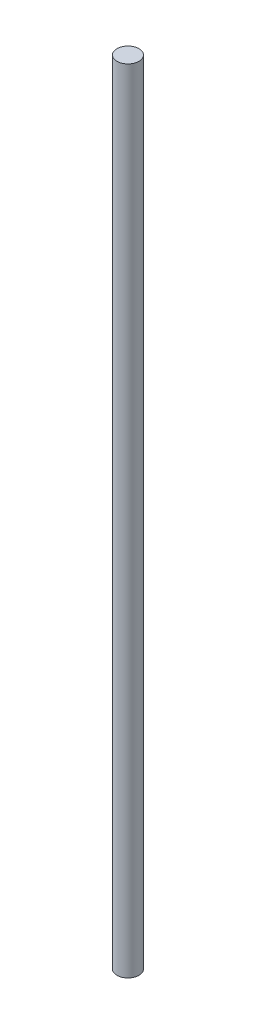
ISO-10303-21;
HEADER;
FILE_DESCRIPTION(('STEP AP214'),'2;1');
FILE_NAME('part.step','',(''),(''),'','','');
FILE_SCHEMA(('AUTOMOTIVE_DESIGN { 1 0 10303 214 1 1 1 1 }'));
ENDSEC;
DATA;
#1=APPLICATION_CONTEXT('core data for automotive mechanical design processes');
#2=APPLICATION_PROTOCOL_DEFINITION('international standard','automotive_design',2000,#1);
#3=PRODUCT_CONTEXT('',#1,'mechanical');
#4=PRODUCT('Part','Part','',(#3));
#5=PRODUCT_RELATED_PRODUCT_CATEGORY('part','',(#4));
#6=PRODUCT_DEFINITION_FORMATION('','',#4);
#7=PRODUCT_DEFINITION_CONTEXT('part definition',#1,'design');
#8=PRODUCT_DEFINITION('design','',#6,#7);
#9=PRODUCT_DEFINITION_SHAPE('','',#8);
#10=(LENGTH_UNIT() NAMED_UNIT(*) SI_UNIT(.MILLI.,.METRE.));
#11=(NAMED_UNIT(*) PLANE_ANGLE_UNIT() SI_UNIT($,.RADIAN.));
#12=(NAMED_UNIT(*) SI_UNIT($,.STERADIAN.) SOLID_ANGLE_UNIT());
#13=UNCERTAINTY_MEASURE_WITH_UNIT(LENGTH_MEASURE(1.E-05),#10,'distance_accuracy_value','');
#14=(GEOMETRIC_REPRESENTATION_CONTEXT(3) GLOBAL_UNCERTAINTY_ASSIGNED_CONTEXT((#13)) GLOBAL_UNIT_ASSIGNED_CONTEXT((#10,
#11,#12)) REPRESENTATION_CONTEXT('',''));
#15=CARTESIAN_POINT('',(0.,0.,0.));
#16=DIRECTION('',(0.,0.,1.));
#17=DIRECTION('',(1.,0.,0.));
#18=AXIS2_PLACEMENT_3D('',#15,#16,#17);
#19=CARTESIAN_POINT('',(0.,228.6,0.));
#20=DIRECTION('',(0.,-1.,0.));
#21=DIRECTION('',(0.,0.,-1.));
#22=AXIS2_PLACEMENT_3D('',#19,#20,#21);
#23=CYLINDRICAL_SURFACE('',#22,3.175);
#24=CARTESIAN_POINT('',(0.,228.6,0.));
#25=DIRECTION('',(0.,1.,0.));
#26=DIRECTION('',(0.,0.,1.));
#27=AXIS2_PLACEMENT_3D('',#24,#25,#26);
#28=CIRCLE('',#27,3.175);
#29=CARTESIAN_POINT('',(0.,228.6,3.175));
#30=VERTEX_POINT('',#29);
#31=EDGE_CURVE('E10',#30,#30,#28,.T.);
#32=ORIENTED_EDGE('',*,*,#31,.F.);
#33=EDGE_LOOP('',(#32));
#34=FACE_BOUND('',#33,.T.);
#35=CARTESIAN_POINT('',(0.,0.,0.));
#36=DIRECTION('',(0.,1.,0.));
#37=DIRECTION('',(0.,0.,1.));
#38=AXIS2_PLACEMENT_3D('',#35,#36,#37);
#39=CIRCLE('',#38,3.175);
#40=CARTESIAN_POINT('',(0.,0.,3.175));
#41=VERTEX_POINT('',#40);
#42=EDGE_CURVE('E34',#41,#41,#39,.T.);
#43=ORIENTED_EDGE('',*,*,#42,.T.);
#44=EDGE_LOOP('',(#43));
#45=FACE_BOUND('',#44,.T.);
#46=ADVANCED_FACE('F31',(#34,#45),#23,.T.);
#47=CARTESIAN_POINT('',(0.,228.6,0.));
#48=DIRECTION('',(0.,1.,0.));
#49=DIRECTION('',(0.,0.,1.));
#50=AXIS2_PLACEMENT_3D('',#47,#48,#49);
#51=PLANE('',#50);
#52=ORIENTED_EDGE('',*,*,#31,.T.);
#53=EDGE_LOOP('',(#52));
#54=FACE_BOUND('',#53,.T.);
#55=ADVANCED_FACE('F46',(#54),#51,.T.);
#56=CARTESIAN_POINT('',(0.,0.,0.));
#57=DIRECTION('',(0.,1.,0.));
#58=DIRECTION('',(0.,0.,1.));
#59=AXIS2_PLACEMENT_3D('',#56,#57,#58);
#60=PLANE('',#59);
#61=ORIENTED_EDGE('',*,*,#42,.F.);
#62=EDGE_LOOP('',(#61));
#63=FACE_BOUND('',#62,.T.);
#64=ADVANCED_FACE('F44',(#63),#60,.F.);
#65=CLOSED_SHELL('',(#46,#55,#64));
#66=MANIFOLD_SOLID_BREP('B2',#65);
#67=ADVANCED_BREP_SHAPE_REPRESENTATION('',(#18,#66),#14);
#68=SHAPE_DEFINITION_REPRESENTATION(#9,#67);
ENDSEC;
END-ISO-10303-21;
